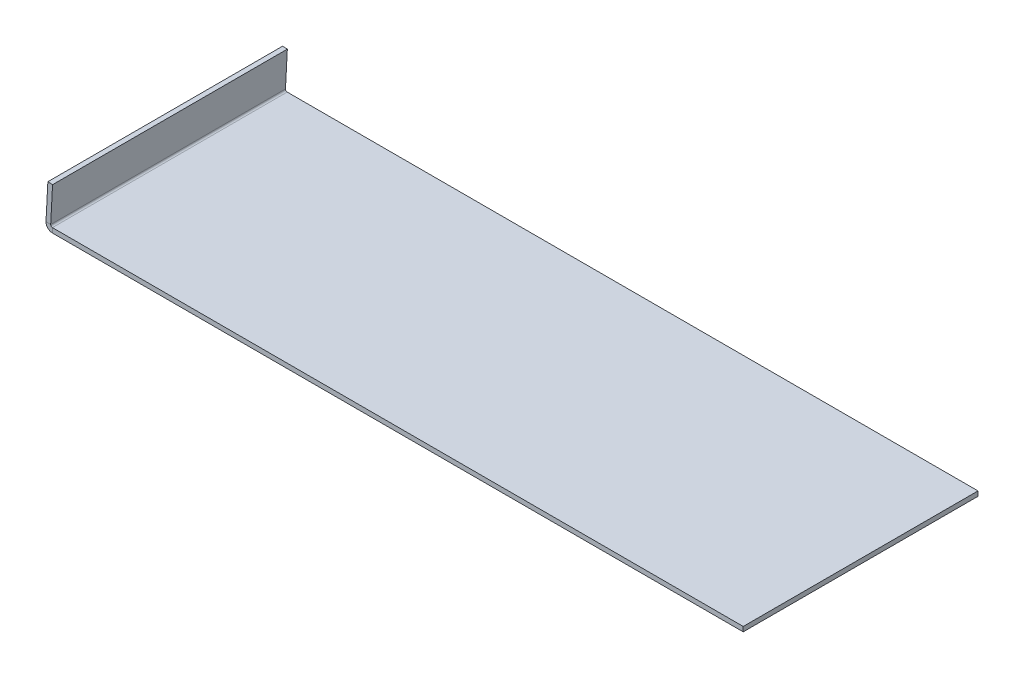
ISO-10303-21;
HEADER;
FILE_DESCRIPTION(('STEP AP214'),'2;1');
FILE_NAME('part.step','',(''),(''),'','','');
FILE_SCHEMA(('AUTOMOTIVE_DESIGN { 1 0 10303 214 1 1 1 1 }'));
ENDSEC;
DATA;
#1=APPLICATION_CONTEXT('core data for automotive mechanical design processes');
#2=APPLICATION_PROTOCOL_DEFINITION('international standard','automotive_design',2000,#1);
#3=PRODUCT_CONTEXT('',#1,'mechanical');
#4=PRODUCT('Part','Part','',(#3));
#5=PRODUCT_RELATED_PRODUCT_CATEGORY('part','',(#4));
#6=PRODUCT_DEFINITION_FORMATION('','',#4);
#7=PRODUCT_DEFINITION_CONTEXT('part definition',#1,'design');
#8=PRODUCT_DEFINITION('design','',#6,#7);
#9=PRODUCT_DEFINITION_SHAPE('','',#8);
#10=(LENGTH_UNIT() NAMED_UNIT(*) SI_UNIT(.MILLI.,.METRE.));
#11=(NAMED_UNIT(*) PLANE_ANGLE_UNIT() SI_UNIT($,.RADIAN.));
#12=(NAMED_UNIT(*) SI_UNIT($,.STERADIAN.) SOLID_ANGLE_UNIT());
#13=UNCERTAINTY_MEASURE_WITH_UNIT(LENGTH_MEASURE(1.E-05),#10,'distance_accuracy_value','');
#14=(GEOMETRIC_REPRESENTATION_CONTEXT(3) GLOBAL_UNCERTAINTY_ASSIGNED_CONTEXT((#13)) GLOBAL_UNIT_ASSIGNED_CONTEXT((#10,
#11,#12)) REPRESENTATION_CONTEXT('',''));
#15=CARTESIAN_POINT('',(0.,0.,0.));
#16=DIRECTION('',(0.,0.,1.));
#17=DIRECTION('',(1.,0.,0.));
#18=AXIS2_PLACEMENT_3D('',#15,#16,#17);
#19=CARTESIAN_POINT('',(-148.5,-2.,50.));
#20=DIRECTION('',(0.,0.,1.));
#21=DIRECTION('',(1.,0.,0.));
#22=AXIS2_PLACEMENT_3D('',#19,#20,#21);
#23=PLANE('',#22);
#24=DIRECTION('',(1.,0.,0.));
#25=VECTOR('',#24,1.);
#26=CARTESIAN_POINT('',(-148.5,0.,50.));
#27=LINE('',#26,#25);
#28=CARTESIAN_POINT('',(-145.721040867722,0.,50.));
#29=VERTEX_POINT('',#28);
#30=CARTESIAN_POINT('',(148.5,0.,50.));
#31=VERTEX_POINT('',#30);
#32=EDGE_CURVE('E108',#29,#31,#27,.T.);
#33=ORIENTED_EDGE('',*,*,#32,.F.);
#34=DIRECTION('',(0.,-1.,0.));
#35=VECTOR('',#34,1.);
#36=CARTESIAN_POINT('',(-145.721040867722,0.,50.));
#37=LINE('',#36,#35);
#38=CARTESIAN_POINT('',(-145.721040867722,-2.00000000000002,50.));
#39=VERTEX_POINT('',#38);
#40=EDGE_CURVE('E126',#29,#39,#37,.T.);
#41=ORIENTED_EDGE('',*,*,#40,.T.);
#42=DIRECTION('',(1.,0.,0.));
#43=VECTOR('',#42,1.);
#44=CARTESIAN_POINT('',(-148.5,-2.,50.));
#45=LINE('',#44,#43);
#46=CARTESIAN_POINT('',(148.5,-2.,50.));
#47=VERTEX_POINT('',#46);
#48=EDGE_CURVE('E93',#39,#47,#45,.T.);
#49=ORIENTED_EDGE('',*,*,#48,.T.);
#50=DIRECTION('',(0.,1.,0.));
#51=VECTOR('',#50,1.);
#52=CARTESIAN_POINT('',(148.5,-2.,50.));
#53=LINE('',#52,#51);
#54=EDGE_CURVE('E15',#47,#31,#53,.T.);
#55=ORIENTED_EDGE('',*,*,#54,.T.);
#56=EDGE_LOOP('',(#33,#41,#49,#55));
#57=FACE_BOUND('',#56,.T.);
#58=ADVANCED_FACE('F70',(#57),#23,.T.);
#59=CARTESIAN_POINT('',(0.,-2.,0.));
#60=DIRECTION('',(0.,-1.,0.));
#61=DIRECTION('',(0.,0.,-1.));
#62=AXIS2_PLACEMENT_3D('',#59,#60,#61);
#63=PLANE('',#62);
#64=ORIENTED_EDGE('',*,*,#48,.F.);
#65=DIRECTION('',(0.,0.,1.));
#66=VECTOR('',#65,1.);
#67=CARTESIAN_POINT('',(-145.721040867722,-2.00000000000002,50.));
#68=LINE('',#67,#66);
#69=CARTESIAN_POINT('',(-145.721040867722,-2.,-50.));
#70=VERTEX_POINT('',#69);
#71=EDGE_CURVE('E146',#39,#70,#68,.F.);
#72=ORIENTED_EDGE('',*,*,#71,.T.);
#73=DIRECTION('',(-1.,0.,0.));
#74=VECTOR('',#73,1.);
#75=CARTESIAN_POINT('',(-148.5,-2.,-50.));
#76=LINE('',#75,#74);
#77=CARTESIAN_POINT('',(148.5,-2.,-50.));
#78=VERTEX_POINT('',#77);
#79=EDGE_CURVE('E130',#78,#70,#76,.T.);
#80=ORIENTED_EDGE('',*,*,#79,.F.);
#81=DIRECTION('',(0.,0.,-1.));
#82=VECTOR('',#81,1.);
#83=CARTESIAN_POINT('',(148.5,-2.,50.));
#84=LINE('',#83,#82);
#85=EDGE_CURVE('E116',#47,#78,#84,.T.);
#86=ORIENTED_EDGE('',*,*,#85,.F.);
#87=EDGE_LOOP('',(#64,#72,#80,#86));
#88=FACE_BOUND('',#87,.T.);
#89=ADVANCED_FACE('F239',(#88),#63,.T.);
#90=CARTESIAN_POINT('',(0.,0.,0.));
#91=DIRECTION('',(0.,-1.,0.));
#92=DIRECTION('',(0.,0.,-1.));
#93=AXIS2_PLACEMENT_3D('',#90,#91,#92);
#94=PLANE('',#93);
#95=DIRECTION('',(0.,0.,1.));
#96=VECTOR('',#95,1.);
#97=CARTESIAN_POINT('',(-145.721040867722,0.,50.));
#98=LINE('',#97,#96);
#99=CARTESIAN_POINT('',(-145.721040867722,0.,-50.));
#100=VERTEX_POINT('',#99);
#101=EDGE_CURVE('E115',#29,#100,#98,.F.);
#102=ORIENTED_EDGE('',*,*,#101,.F.);
#103=ORIENTED_EDGE('',*,*,#32,.T.);
#104=DIRECTION('',(0.,0.,-1.));
#105=VECTOR('',#104,1.);
#106=CARTESIAN_POINT('',(148.5,0.,50.));
#107=LINE('',#106,#105);
#108=CARTESIAN_POINT('',(148.5,0.,-50.));
#109=VERTEX_POINT('',#108);
#110=EDGE_CURVE('E112',#31,#109,#107,.T.);
#111=ORIENTED_EDGE('',*,*,#110,.T.);
#112=DIRECTION('',(-1.,0.,0.));
#113=VECTOR('',#112,1.);
#114=CARTESIAN_POINT('',(-148.5,0.,-50.));
#115=LINE('',#114,#113);
#116=EDGE_CURVE('E117',#109,#100,#115,.T.);
#117=ORIENTED_EDGE('',*,*,#116,.T.);
#118=EDGE_LOOP('',(#102,#103,#111,#117));
#119=FACE_BOUND('',#118,.T.);
#120=ADVANCED_FACE('F109',(#119),#94,.F.);
#121=CARTESIAN_POINT('',(148.5,-2.,50.));
#122=DIRECTION('',(1.,0.,0.));
#123=DIRECTION('',(0.,0.,-1.));
#124=AXIS2_PLACEMENT_3D('',#121,#122,#123);
#125=PLANE('',#124);
#126=ORIENTED_EDGE('',*,*,#110,.F.);
#127=ORIENTED_EDGE('',*,*,#54,.F.);
#128=ORIENTED_EDGE('',*,*,#85,.T.);
#129=DIRECTION('',(0.,1.,0.));
#130=VECTOR('',#129,1.);
#131=CARTESIAN_POINT('',(148.5,-2.,-50.));
#132=LINE('',#131,#130);
#133=EDGE_CURVE('E74',#78,#109,#132,.T.);
#134=ORIENTED_EDGE('',*,*,#133,.T.);
#135=EDGE_LOOP('',(#126,#127,#128,#134));
#136=FACE_BOUND('',#135,.T.);
#137=ADVANCED_FACE('F72',(#136),#125,.T.);
#138=CARTESIAN_POINT('',(-148.5,-2.,-50.));
#139=DIRECTION('',(0.,0.,-1.));
#140=DIRECTION('',(-1.,0.,0.));
#141=AXIS2_PLACEMENT_3D('',#138,#139,#140);
#142=PLANE('',#141);
#143=DIRECTION('',(0.,-1.,0.));
#144=VECTOR('',#143,1.);
#145=CARTESIAN_POINT('',(-145.721040867722,0.,-50.));
#146=LINE('',#145,#144);
#147=EDGE_CURVE('E123',#100,#70,#146,.T.);
#148=ORIENTED_EDGE('',*,*,#147,.F.);
#149=ORIENTED_EDGE('',*,*,#116,.F.);
#150=ORIENTED_EDGE('',*,*,#133,.F.);
#151=ORIENTED_EDGE('',*,*,#79,.T.);
#152=EDGE_LOOP('',(#148,#149,#150,#151));
#153=FACE_BOUND('',#152,.T.);
#154=ADVANCED_FACE('F236',(#153),#142,.T.);
#155=CARTESIAN_POINT('',(-145.721040867722,0.73659999999999,-50.));
#156=DIRECTION('',(0.,0.,-1.));
#157=DIRECTION('',(-1.,0.,0.));
#158=AXIS2_PLACEMENT_3D('',#155,#156,#157);
#159=PLANE('',#158);
#160=DIRECTION('',(0.998629534754574,-0.0523359562429407,0.));
#161=VECTOR('',#160,1.);
#162=CARTESIAN_POINT('',(-148.453890452532,0.879822577854422,-50.));
#163=LINE('',#162,#161);
#164=CARTESIAN_POINT('',(-146.456631383022,0.77515066536854,-50.));
#165=VERTEX_POINT('',#164);
#166=CARTESIAN_POINT('',(-148.453890452532,0.879822577854422,-50.));
#167=VERTEX_POINT('',#166);
#168=EDGE_CURVE('E150',#165,#167,#163,.F.);
#169=ORIENTED_EDGE('',*,*,#168,.F.);
#170=CARTESIAN_POINT('',(-145.721040867722,0.73659999999999,-50.));
#171=DIRECTION('',(0.,0.,1.));
#172=DIRECTION('',(1.,0.,0.));
#173=AXIS2_PLACEMENT_3D('',#170,#171,#172);
#174=CIRCLE('',#173,0.736600000000008);
#175=EDGE_CURVE('E140',#100,#165,#174,.F.);
#176=ORIENTED_EDGE('',*,*,#175,.F.);
#177=ORIENTED_EDGE('',*,*,#147,.T.);
#178=CARTESIAN_POINT('',(-145.721040867722,0.73659999999999,-50.));
#179=DIRECTION('',(0.,0.,1.));
#180=DIRECTION('',(1.,0.,0.));
#181=AXIS2_PLACEMENT_3D('',#178,#179,#180);
#182=CIRCLE('',#181,2.73660000000001);
#183=EDGE_CURVE('E85',#70,#167,#182,.F.);
#184=ORIENTED_EDGE('',*,*,#183,.T.);
#185=EDGE_LOOP('',(#169,#176,#177,#184));
#186=FACE_BOUND('',#185,.T.);
#187=ADVANCED_FACE('F233',(#186),#159,.T.);
#188=CARTESIAN_POINT('',(-145.721040867722,0.73659999999999,50.));
#189=DIRECTION('',(0.,0.,-1.));
#190=DIRECTION('',(-1.,0.,0.));
#191=AXIS2_PLACEMENT_3D('',#188,#189,#190);
#192=PLANE('',#191);
#193=CARTESIAN_POINT('',(-145.721040867722,0.73659999999999,50.));
#194=DIRECTION('',(0.,0.,1.));
#195=DIRECTION('',(1.,0.,0.));
#196=AXIS2_PLACEMENT_3D('',#193,#194,#195);
#197=CIRCLE('',#196,0.736600000000008);
#198=CARTESIAN_POINT('',(-146.456631383022,0.77515066536854,50.));
#199=VERTEX_POINT('',#198);
#200=EDGE_CURVE('E135',#199,#29,#197,.T.);
#201=ORIENTED_EDGE('',*,*,#200,.F.);
#202=DIRECTION('',(0.998629534754574,-0.0523359562429407,0.));
#203=VECTOR('',#202,1.);
#204=CARTESIAN_POINT('',(-146.456631383022,0.77515066536854,50.));
#205=LINE('',#204,#203);
#206=CARTESIAN_POINT('',(-148.453890452532,0.879822577854422,50.));
#207=VERTEX_POINT('',#206);
#208=EDGE_CURVE('E156',#199,#207,#205,.F.);
#209=ORIENTED_EDGE('',*,*,#208,.T.);
#210=CARTESIAN_POINT('',(-145.721040867722,0.73659999999999,50.));
#211=DIRECTION('',(0.,0.,1.));
#212=DIRECTION('',(1.,0.,0.));
#213=AXIS2_PLACEMENT_3D('',#210,#211,#212);
#214=CIRCLE('',#213,2.73660000000001);
#215=EDGE_CURVE('E143',#207,#39,#214,.T.);
#216=ORIENTED_EDGE('',*,*,#215,.T.);
#217=ORIENTED_EDGE('',*,*,#40,.F.);
#218=EDGE_LOOP('',(#201,#209,#216,#217));
#219=FACE_BOUND('',#218,.T.);
#220=ADVANCED_FACE('F230',(#219),#192,.F.);
#221=CARTESIAN_POINT('',(-145.721040867722,0.73659999999999,50.));
#222=DIRECTION('',(0.,0.,1.));
#223=DIRECTION('',(-0.998629534754574,0.0523359562429407,0.));
#224=AXIS2_PLACEMENT_3D('',#221,#222,#223);
#225=CYLINDRICAL_SURFACE('',#224,2.73660000000001);
#226=ORIENTED_EDGE('',*,*,#71,.F.);
#227=ORIENTED_EDGE('',*,*,#215,.F.);
#228=DIRECTION('',(0.,0.,1.));
#229=VECTOR('',#228,1.);
#230=CARTESIAN_POINT('',(-148.453890452532,0.879822577854422,-50.));
#231=LINE('',#230,#229);
#232=EDGE_CURVE('E159',#207,#167,#231,.F.);
#233=ORIENTED_EDGE('',*,*,#232,.T.);
#234=ORIENTED_EDGE('',*,*,#183,.F.);
#235=EDGE_LOOP('',(#226,#227,#233,#234));
#236=FACE_BOUND('',#235,.T.);
#237=ADVANCED_FACE('F240',(#236),#225,.T.);
#238=CARTESIAN_POINT('',(-145.721040867722,0.73659999999999,50.));
#239=DIRECTION('',(0.,0.,1.));
#240=DIRECTION('',(-0.998629534754574,0.0523359562429407,0.));
#241=AXIS2_PLACEMENT_3D('',#238,#239,#240);
#242=CYLINDRICAL_SURFACE('',#241,0.736600000000008);
#243=ORIENTED_EDGE('',*,*,#101,.T.);
#244=ORIENTED_EDGE('',*,*,#175,.T.);
#245=DIRECTION('',(0.,0.,1.));
#246=VECTOR('',#245,1.);
#247=CARTESIAN_POINT('',(-146.456631383022,0.77515066536854,-50.));
#248=LINE('',#247,#246);
#249=EDGE_CURVE('E153',#165,#199,#248,.T.);
#250=ORIENTED_EDGE('',*,*,#249,.T.);
#251=ORIENTED_EDGE('',*,*,#200,.T.);
#252=EDGE_LOOP('',(#243,#244,#250,#251));
#253=FACE_BOUND('',#252,.T.);
#254=ADVANCED_FACE('F232',(#253),#242,.F.);
#255=CARTESIAN_POINT('',(-148.494514377513,0.104671912485881,-50.));
#256=DIRECTION('',(0.,0.,1.));
#257=DIRECTION('',(1.,0.,0.));
#258=AXIS2_PLACEMENT_3D('',#255,#256,#257);
#259=PLANE('',#258);
#260=ORIENTED_EDGE('',*,*,#168,.T.);
#261=DIRECTION('',(-0.0523359562429407,-0.998629534754574,0.));
#262=VECTOR('',#261,1.);
#263=CARTESIAN_POINT('',(-148.087765108608,7.86591031010869,-50.));
#264=LINE('',#263,#262);
#265=CARTESIAN_POINT('',(-147.662768346193,15.9753316255823,-50.));
#266=VERTEX_POINT('',#265);
#267=EDGE_CURVE('E170',#266,#167,#264,.T.);
#268=ORIENTED_EDGE('',*,*,#267,.F.);
#269=DIRECTION('',(0.998629534754574,-0.0523359562429404,0.));
#270=VECTOR('',#269,1.);
#271=CARTESIAN_POINT('',(-147.662768346193,15.9753316255823,-50.));
#272=LINE('',#271,#270);
#273=CARTESIAN_POINT('',(-145.665509276684,15.8706597130964,-50.));
#274=VERTEX_POINT('',#273);
#275=EDGE_CURVE('E179',#266,#274,#272,.T.);
#276=ORIENTED_EDGE('',*,*,#275,.T.);
#277=DIRECTION('',(0.0523359562429407,0.998629534754574,0.));
#278=VECTOR('',#277,1.);
#279=CARTESIAN_POINT('',(-146.497255308004,0.,-50.));
#280=LINE('',#279,#278);
#281=EDGE_CURVE('E161',#274,#165,#280,.F.);
#282=ORIENTED_EDGE('',*,*,#281,.T.);
#283=EDGE_LOOP('',(#260,#268,#276,#282));
#284=FACE_BOUND('',#283,.T.);
#285=ADVANCED_FACE('F205',(#284),#259,.F.);
#286=CARTESIAN_POINT('',(-147.662768346193,15.9753316255823,50.));
#287=DIRECTION('',(0.,0.,-1.));
#288=DIRECTION('',(-1.,0.,0.));
#289=AXIS2_PLACEMENT_3D('',#286,#287,#288);
#290=PLANE('',#289);
#291=ORIENTED_EDGE('',*,*,#208,.F.);
#292=DIRECTION('',(-0.0523359562429407,-0.998629534754574,0.));
#293=VECTOR('',#292,1.);
#294=CARTESIAN_POINT('',(-145.665509276684,15.8706597130964,50.));
#295=LINE('',#294,#293);
#296=CARTESIAN_POINT('',(-145.665509276684,15.8706597130964,50.));
#297=VERTEX_POINT('',#296);
#298=EDGE_CURVE('E164',#199,#297,#295,.F.);
#299=ORIENTED_EDGE('',*,*,#298,.T.);
#300=DIRECTION('',(0.998629534754574,-0.0523359562429404,0.));
#301=VECTOR('',#300,1.);
#302=CARTESIAN_POINT('',(-147.662768346193,15.9753316255823,50.));
#303=LINE('',#302,#301);
#304=CARTESIAN_POINT('',(-147.662768346193,15.9753316255823,50.));
#305=VERTEX_POINT('',#304);
#306=EDGE_CURVE('E138',#305,#297,#303,.T.);
#307=ORIENTED_EDGE('',*,*,#306,.F.);
#308=DIRECTION('',(0.0523359562429407,0.998629534754574,0.));
#309=VECTOR('',#308,1.);
#310=CARTESIAN_POINT('',(-148.087765108608,7.86591031010869,50.));
#311=LINE('',#310,#309);
#312=EDGE_CURVE('E173',#207,#305,#311,.T.);
#313=ORIENTED_EDGE('',*,*,#312,.F.);
#314=EDGE_LOOP('',(#291,#299,#307,#313));
#315=FACE_BOUND('',#314,.T.);
#316=ADVANCED_FACE('F227',(#315),#290,.F.);
#317=CARTESIAN_POINT('',(-148.087765108608,7.86591031010869,0.));
#318=DIRECTION('',(0.998629534754574,-0.0523359562429407,0.));
#319=DIRECTION('',(0.0523359562429407,0.998629534754574,0.));
#320=AXIS2_PLACEMENT_3D('',#317,#318,#319);
#321=PLANE('',#320);
#322=ORIENTED_EDGE('',*,*,#232,.F.);
#323=ORIENTED_EDGE('',*,*,#312,.T.);
#324=DIRECTION('',(0.,0.,-1.));
#325=VECTOR('',#324,1.);
#326=CARTESIAN_POINT('',(-147.662768346193,15.9753316255823,0.));
#327=LINE('',#326,#325);
#328=EDGE_CURVE('E176',#305,#266,#327,.T.);
#329=ORIENTED_EDGE('',*,*,#328,.T.);
#330=ORIENTED_EDGE('',*,*,#267,.T.);
#331=EDGE_LOOP('',(#322,#323,#329,#330));
#332=FACE_BOUND('',#331,.T.);
#333=ADVANCED_FACE('F225',(#332),#321,.F.);
#334=CARTESIAN_POINT('',(-146.090506039098,7.76123839762281,0.));
#335=DIRECTION('',(0.998629534754574,-0.0523359562429407,0.));
#336=DIRECTION('',(0.0523359562429407,0.998629534754574,0.));
#337=AXIS2_PLACEMENT_3D('',#334,#335,#336);
#338=PLANE('',#337);
#339=ORIENTED_EDGE('',*,*,#298,.F.);
#340=ORIENTED_EDGE('',*,*,#249,.F.);
#341=ORIENTED_EDGE('',*,*,#281,.F.);
#342=DIRECTION('',(0.,0.,1.));
#343=VECTOR('',#342,1.);
#344=CARTESIAN_POINT('',(-145.665509276684,15.8706597130964,-50.));
#345=LINE('',#344,#343);
#346=EDGE_CURVE('E167',#297,#274,#345,.F.);
#347=ORIENTED_EDGE('',*,*,#346,.F.);
#348=EDGE_LOOP('',(#339,#340,#341,#347));
#349=FACE_BOUND('',#348,.T.);
#350=ADVANCED_FACE('F199',(#349),#338,.T.);
#351=CARTESIAN_POINT('',(-147.662768346193,15.9753316255823,-50.));
#352=DIRECTION('',(-0.0523359562429404,-0.998629534754574,0.));
#353=DIRECTION('',(0.998629534754574,-0.0523359562429404,0.));
#354=AXIS2_PLACEMENT_3D('',#351,#352,#353);
#355=PLANE('',#354);
#356=ORIENTED_EDGE('',*,*,#346,.T.);
#357=ORIENTED_EDGE('',*,*,#275,.F.);
#358=ORIENTED_EDGE('',*,*,#328,.F.);
#359=ORIENTED_EDGE('',*,*,#306,.T.);
#360=EDGE_LOOP('',(#356,#357,#358,#359));
#361=FACE_BOUND('',#360,.T.);
#362=ADVANCED_FACE('F188',(#361),#355,.F.);
#363=CLOSED_SHELL('',(#58,#89,#120,#137,#154,#187,#220,#237,#254,#285,#316,#333,#350,#362));
#364=MANIFOLD_SOLID_BREP('B2',#363);
#365=ADVANCED_BREP_SHAPE_REPRESENTATION('',(#18,#364),#14);
#366=SHAPE_DEFINITION_REPRESENTATION(#9,#365);
ENDSEC;
END-ISO-10303-21;
